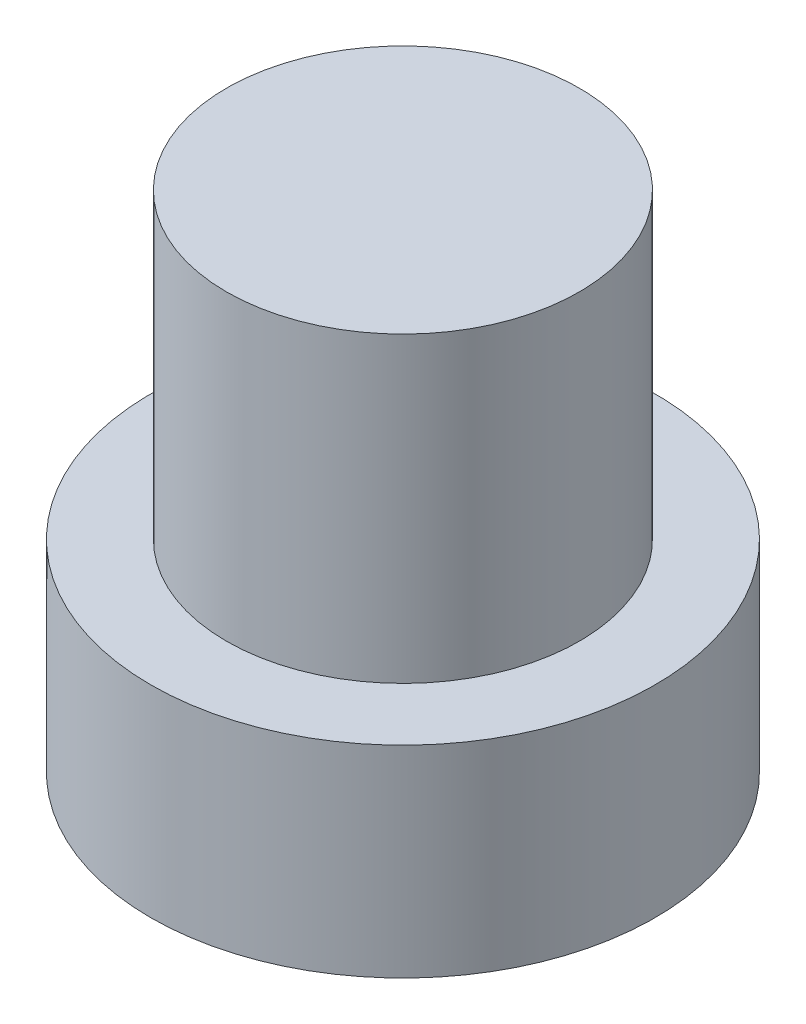
ISO-10303-21;
HEADER;
FILE_DESCRIPTION(('STEP AP214'),'2;1');
FILE_NAME('part.step','',(''),(''),'','','');
FILE_SCHEMA(('AUTOMOTIVE_DESIGN { 1 0 10303 214 1 1 1 1 }'));
ENDSEC;
DATA;
#1=APPLICATION_CONTEXT('core data for automotive mechanical design processes');
#2=APPLICATION_PROTOCOL_DEFINITION('international standard','automotive_design',2000,#1);
#3=PRODUCT_CONTEXT('',#1,'mechanical');
#4=PRODUCT('Part','Part','',(#3));
#5=PRODUCT_RELATED_PRODUCT_CATEGORY('part','',(#4));
#6=PRODUCT_DEFINITION_FORMATION('','',#4);
#7=PRODUCT_DEFINITION_CONTEXT('part definition',#1,'design');
#8=PRODUCT_DEFINITION('design','',#6,#7);
#9=PRODUCT_DEFINITION_SHAPE('','',#8);
#10=(LENGTH_UNIT() NAMED_UNIT(*) SI_UNIT(.MILLI.,.METRE.));
#11=(NAMED_UNIT(*) PLANE_ANGLE_UNIT() SI_UNIT($,.RADIAN.));
#12=(NAMED_UNIT(*) SI_UNIT($,.STERADIAN.) SOLID_ANGLE_UNIT());
#13=UNCERTAINTY_MEASURE_WITH_UNIT(LENGTH_MEASURE(1.E-05),#10,'distance_accuracy_value','');
#14=(GEOMETRIC_REPRESENTATION_CONTEXT(3) GLOBAL_UNCERTAINTY_ASSIGNED_CONTEXT((#13)) GLOBAL_UNIT_ASSIGNED_CONTEXT((#10,
#11,#12)) REPRESENTATION_CONTEXT('',''));
#15=CARTESIAN_POINT('',(0.,0.,0.));
#16=DIRECTION('',(0.,0.,1.));
#17=DIRECTION('',(1.,0.,0.));
#18=AXIS2_PLACEMENT_3D('',#15,#16,#17);
#19=CARTESIAN_POINT('',(0.,4.,0.));
#20=DIRECTION('',(0.,-1.,0.));
#21=DIRECTION('',(0.,0.,-1.));
#22=AXIS2_PLACEMENT_3D('',#19,#20,#21);
#23=CYLINDRICAL_SURFACE('',#22,5.);
#24=CARTESIAN_POINT('',(0.,4.,0.));
#25=DIRECTION('',(0.,1.,0.));
#26=DIRECTION('',(0.,0.,1.));
#27=AXIS2_PLACEMENT_3D('',#24,#25,#26);
#28=CIRCLE('',#27,5.);
#29=CARTESIAN_POINT('',(0.,4.,5.));
#30=VERTEX_POINT('',#29);
#31=EDGE_CURVE('E41',#30,#30,#28,.T.);
#32=ORIENTED_EDGE('',*,*,#31,.F.);
#33=EDGE_LOOP('',(#32));
#34=FACE_BOUND('',#33,.T.);
#35=CARTESIAN_POINT('',(0.,0.,0.));
#36=DIRECTION('',(0.,1.,0.));
#37=DIRECTION('',(0.,0.,1.));
#38=AXIS2_PLACEMENT_3D('',#35,#36,#37);
#39=CIRCLE('',#38,5.);
#40=CARTESIAN_POINT('',(0.,0.,5.));
#41=VERTEX_POINT('',#40);
#42=EDGE_CURVE('E37',#41,#41,#39,.T.);
#43=ORIENTED_EDGE('',*,*,#42,.T.);
#44=EDGE_LOOP('',(#43));
#45=FACE_BOUND('',#44,.T.);
#46=ADVANCED_FACE('F34',(#34,#45),#23,.T.);
#47=CARTESIAN_POINT('',(0.,4.,0.));
#48=DIRECTION('',(0.,1.,0.));
#49=DIRECTION('',(0.,0.,1.));
#50=AXIS2_PLACEMENT_3D('',#47,#48,#49);
#51=PLANE('',#50);
#52=CARTESIAN_POINT('',(0.,4.,0.));
#53=DIRECTION('',(0.,1.,0.));
#54=DIRECTION('',(0.,0.,1.));
#55=AXIS2_PLACEMENT_3D('',#52,#53,#54);
#56=CIRCLE('',#55,3.5);
#57=CARTESIAN_POINT('',(0.,4.,3.5));
#58=VERTEX_POINT('',#57);
#59=EDGE_CURVE('E10',#58,#58,#56,.T.);
#60=ORIENTED_EDGE('',*,*,#59,.F.);
#61=EDGE_LOOP('',(#60));
#62=FACE_BOUND('',#61,.T.);
#63=ORIENTED_EDGE('',*,*,#31,.T.);
#64=EDGE_LOOP('',(#63));
#65=FACE_BOUND('',#64,.T.);
#66=ADVANCED_FACE('F58',(#62,#65),#51,.T.);
#67=CARTESIAN_POINT('',(0.,0.,0.));
#68=DIRECTION('',(0.,1.,0.));
#69=DIRECTION('',(0.,0.,1.));
#70=AXIS2_PLACEMENT_3D('',#67,#68,#69);
#71=PLANE('',#70);
#72=ORIENTED_EDGE('',*,*,#42,.F.);
#73=EDGE_LOOP('',(#72));
#74=FACE_BOUND('',#73,.T.);
#75=ADVANCED_FACE('F55',(#74),#71,.F.);
#76=CARTESIAN_POINT('',(0.,10.,0.));
#77=DIRECTION('',(0.,-1.,0.));
#78=DIRECTION('',(0.,0.,-1.));
#79=AXIS2_PLACEMENT_3D('',#76,#77,#78);
#80=CYLINDRICAL_SURFACE('',#79,3.5);
#81=CARTESIAN_POINT('',(0.,10.,0.));
#82=DIRECTION('',(0.,1.,0.));
#83=DIRECTION('',(0.,0.,1.));
#84=AXIS2_PLACEMENT_3D('',#81,#82,#83);
#85=CIRCLE('',#84,3.5);
#86=CARTESIAN_POINT('',(0.,10.,3.5));
#87=VERTEX_POINT('',#86);
#88=EDGE_CURVE('E47',#87,#87,#85,.T.);
#89=ORIENTED_EDGE('',*,*,#88,.F.);
#90=EDGE_LOOP('',(#89));
#91=FACE_BOUND('',#90,.T.);
#92=ORIENTED_EDGE('',*,*,#59,.T.);
#93=EDGE_LOOP('',(#92));
#94=FACE_BOUND('',#93,.T.);
#95=ADVANCED_FACE('F57',(#91,#94),#80,.T.);
#96=CARTESIAN_POINT('',(0.,10.,0.));
#97=DIRECTION('',(0.,1.,0.));
#98=DIRECTION('',(0.,0.,1.));
#99=AXIS2_PLACEMENT_3D('',#96,#97,#98);
#100=PLANE('',#99);
#101=ORIENTED_EDGE('',*,*,#88,.T.);
#102=EDGE_LOOP('',(#101));
#103=FACE_BOUND('',#102,.T.);
#104=ADVANCED_FACE('F63',(#103),#100,.T.);
#105=CLOSED_SHELL('',(#46,#66,#75,#95,#104));
#106=MANIFOLD_SOLID_BREP('B2',#105);
#107=ADVANCED_BREP_SHAPE_REPRESENTATION('',(#18,#106),#14);
#108=SHAPE_DEFINITION_REPRESENTATION(#9,#107);
ENDSEC;
END-ISO-10303-21;
